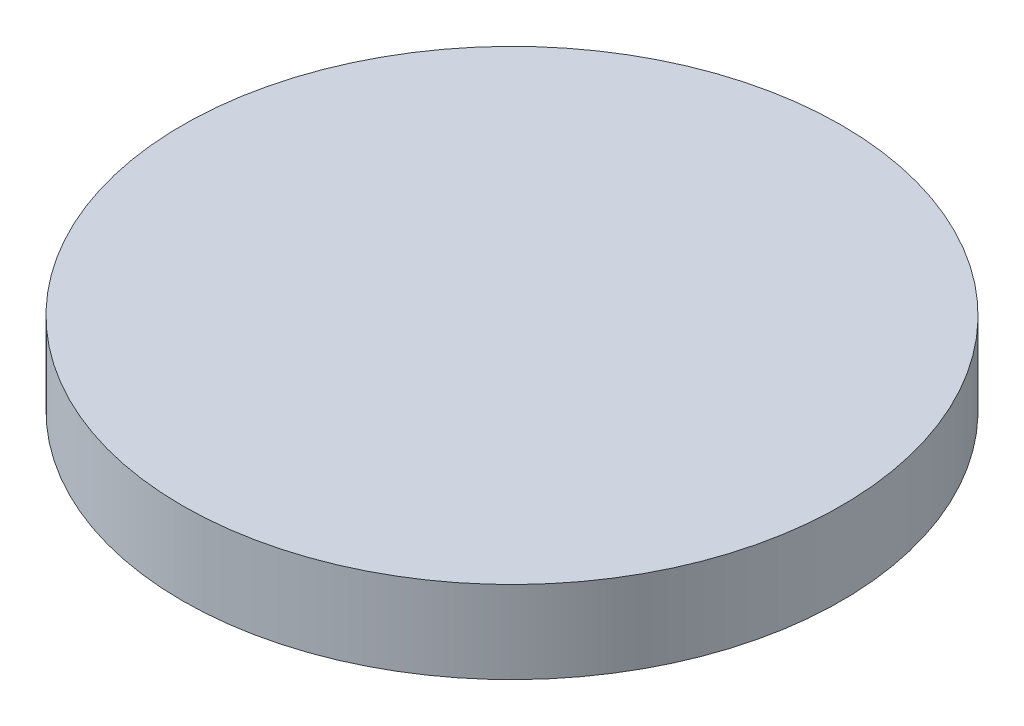
ISO-10303-21;
HEADER;
FILE_DESCRIPTION(('STEP AP214'),'2;1');
FILE_NAME('part.step','',(''),(''),'','','');
FILE_SCHEMA(('AUTOMOTIVE_DESIGN { 1 0 10303 214 1 1 1 1 }'));
ENDSEC;
DATA;
#1=APPLICATION_CONTEXT('core data for automotive mechanical design processes');
#2=APPLICATION_PROTOCOL_DEFINITION('international standard','automotive_design',2000,#1);
#3=PRODUCT_CONTEXT('',#1,'mechanical');
#4=PRODUCT('Part','Part','',(#3));
#5=PRODUCT_RELATED_PRODUCT_CATEGORY('part','',(#4));
#6=PRODUCT_DEFINITION_FORMATION('','',#4);
#7=PRODUCT_DEFINITION_CONTEXT('part definition',#1,'design');
#8=PRODUCT_DEFINITION('design','',#6,#7);
#9=PRODUCT_DEFINITION_SHAPE('','',#8);
#10=(LENGTH_UNIT() NAMED_UNIT(*) SI_UNIT(.MILLI.,.METRE.));
#11=(NAMED_UNIT(*) PLANE_ANGLE_UNIT() SI_UNIT($,.RADIAN.));
#12=(NAMED_UNIT(*) SI_UNIT($,.STERADIAN.) SOLID_ANGLE_UNIT());
#13=UNCERTAINTY_MEASURE_WITH_UNIT(LENGTH_MEASURE(1.E-05),#10,'distance_accuracy_value','');
#14=(GEOMETRIC_REPRESENTATION_CONTEXT(3) GLOBAL_UNCERTAINTY_ASSIGNED_CONTEXT((#13)) GLOBAL_UNIT_ASSIGNED_CONTEXT((#10,
#11,#12)) REPRESENTATION_CONTEXT('',''));
#15=CARTESIAN_POINT('',(0.,0.,0.));
#16=DIRECTION('',(0.,0.,1.));
#17=DIRECTION('',(1.,0.,0.));
#18=AXIS2_PLACEMENT_3D('',#15,#16,#17);
#19=CARTESIAN_POINT('',(0.,3.175,0.));
#20=DIRECTION('',(0.,1.,0.));
#21=DIRECTION('',(0.,0.,1.));
#22=AXIS2_PLACEMENT_3D('',#19,#20,#21);
#23=PLANE('',#22);
#24=CARTESIAN_POINT('',(0.,3.175,0.));
#25=DIRECTION('',(0.,1.,0.));
#26=DIRECTION('',(0.,0.,1.));
#27=AXIS2_PLACEMENT_3D('',#24,#25,#26);
#28=CIRCLE('',#27,12.7);
#29=CARTESIAN_POINT('',(0.,3.175,12.7));
#30=VERTEX_POINT('',#29);
#31=EDGE_CURVE('E35',#30,#30,#28,.T.);
#32=ORIENTED_EDGE('',*,*,#31,.F.);
#33=EDGE_LOOP('',(#32));
#34=FACE_BOUND('',#33,.T.);
#35=ADVANCED_FACE('F31',(#34),#23,.F.);
#36=CARTESIAN_POINT('',(0.,6.35,0.));
#37=DIRECTION('',(0.,-1.,0.));
#38=DIRECTION('',(0.,0.,-1.));
#39=AXIS2_PLACEMENT_3D('',#36,#37,#38);
#40=CYLINDRICAL_SURFACE('',#39,12.7);
#41=CARTESIAN_POINT('',(0.,6.35,0.));
#42=DIRECTION('',(0.,1.,0.));
#43=DIRECTION('',(0.,0.,1.));
#44=AXIS2_PLACEMENT_3D('',#41,#42,#43);
#45=CIRCLE('',#44,12.7);
#46=CARTESIAN_POINT('',(0.,6.35,12.7));
#47=VERTEX_POINT('',#46);
#48=EDGE_CURVE('E10',#47,#47,#45,.T.);
#49=ORIENTED_EDGE('',*,*,#48,.F.);
#50=EDGE_LOOP('',(#49));
#51=FACE_BOUND('',#50,.T.);
#52=ORIENTED_EDGE('',*,*,#31,.T.);
#53=EDGE_LOOP('',(#52));
#54=FACE_BOUND('',#53,.T.);
#55=ADVANCED_FACE('F33',(#51,#54),#40,.T.);
#56=CARTESIAN_POINT('',(0.,6.35,0.));
#57=DIRECTION('',(0.,1.,0.));
#58=DIRECTION('',(0.,0.,1.));
#59=AXIS2_PLACEMENT_3D('',#56,#57,#58);
#60=PLANE('',#59);
#61=ORIENTED_EDGE('',*,*,#48,.T.);
#62=EDGE_LOOP('',(#61));
#63=FACE_BOUND('',#62,.T.);
#64=ADVANCED_FACE('F46',(#63),#60,.T.);
#65=CLOSED_SHELL('',(#35,#55,#64));
#66=MANIFOLD_SOLID_BREP('B2',#65);
#67=ADVANCED_BREP_SHAPE_REPRESENTATION('',(#18,#66),#14);
#68=SHAPE_DEFINITION_REPRESENTATION(#9,#67);
ENDSEC;
END-ISO-10303-21;
